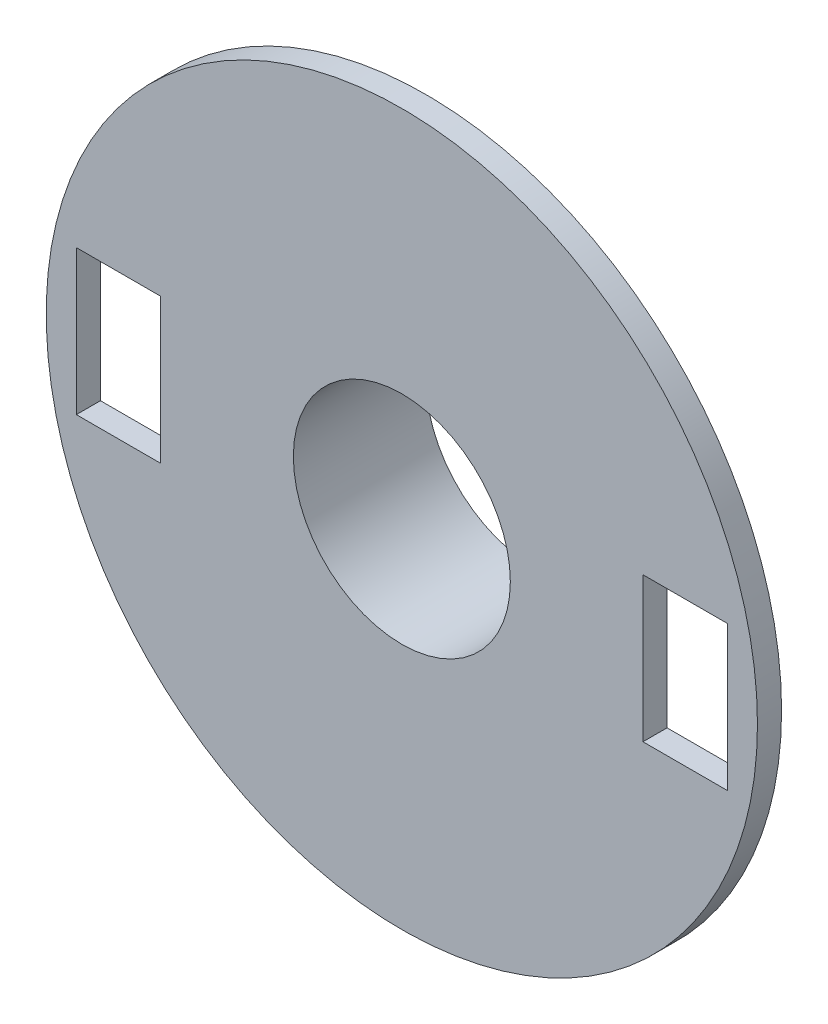
ISO-10303-21;
HEADER;
FILE_DESCRIPTION(('STEP AP214'),'2;1');
FILE_NAME('part.step','',(''),(''),'','','');
FILE_SCHEMA(('AUTOMOTIVE_DESIGN { 1 0 10303 214 1 1 1 1 }'));
ENDSEC;
DATA;
#1=APPLICATION_CONTEXT('core data for automotive mechanical design processes');
#2=APPLICATION_PROTOCOL_DEFINITION('international standard','automotive_design',2000,#1);
#3=PRODUCT_CONTEXT('',#1,'mechanical');
#4=PRODUCT('Part','Part','',(#3));
#5=PRODUCT_RELATED_PRODUCT_CATEGORY('part','',(#4));
#6=PRODUCT_DEFINITION_FORMATION('','',#4);
#7=PRODUCT_DEFINITION_CONTEXT('part definition',#1,'design');
#8=PRODUCT_DEFINITION('design','',#6,#7);
#9=PRODUCT_DEFINITION_SHAPE('','',#8);
#10=(LENGTH_UNIT() NAMED_UNIT(*) SI_UNIT(.MILLI.,.METRE.));
#11=(NAMED_UNIT(*) PLANE_ANGLE_UNIT() SI_UNIT($,.RADIAN.));
#12=(NAMED_UNIT(*) SI_UNIT($,.STERADIAN.) SOLID_ANGLE_UNIT());
#13=UNCERTAINTY_MEASURE_WITH_UNIT(LENGTH_MEASURE(1.E-05),#10,'distance_accuracy_value','');
#14=(GEOMETRIC_REPRESENTATION_CONTEXT(3) GLOBAL_UNCERTAINTY_ASSIGNED_CONTEXT((#13)) GLOBAL_UNIT_ASSIGNED_CONTEXT((#10,
#11,#12)) REPRESENTATION_CONTEXT('',''));
#15=CARTESIAN_POINT('',(0.,0.,0.));
#16=DIRECTION('',(0.,0.,1.));
#17=DIRECTION('',(1.,0.,0.));
#18=AXIS2_PLACEMENT_3D('',#15,#16,#17);
#19=CARTESIAN_POINT('',(0.,0.,1.));
#20=DIRECTION('',(0.,0.,-1.));
#21=DIRECTION('',(-1.,0.,0.));
#22=AXIS2_PLACEMENT_3D('',#19,#20,#21);
#23=CYLINDRICAL_SURFACE('',#22,14.75);
#24=CARTESIAN_POINT('',(0.,0.,1.));
#25=DIRECTION('',(0.,0.,1.));
#26=DIRECTION('',(1.,0.,0.));
#27=AXIS2_PLACEMENT_3D('',#24,#25,#26);
#28=CIRCLE('',#27,14.75);
#29=CARTESIAN_POINT('',(14.75,0.,1.));
#30=VERTEX_POINT('',#29);
#31=EDGE_CURVE('E167',#30,#30,#28,.T.);
#32=ORIENTED_EDGE('',*,*,#31,.F.);
#33=EDGE_LOOP('',(#32));
#34=FACE_BOUND('',#33,.T.);
#35=CARTESIAN_POINT('',(0.,0.,0.));
#36=DIRECTION('',(0.,0.,1.));
#37=DIRECTION('',(1.,0.,0.));
#38=AXIS2_PLACEMENT_3D('',#35,#36,#37);
#39=CIRCLE('',#38,14.75);
#40=CARTESIAN_POINT('',(14.75,0.,0.));
#41=VERTEX_POINT('',#40);
#42=EDGE_CURVE('E162',#41,#41,#39,.T.);
#43=ORIENTED_EDGE('',*,*,#42,.T.);
#44=EDGE_LOOP('',(#43));
#45=FACE_BOUND('',#44,.T.);
#46=ADVANCED_FACE('F35',(#34,#45),#23,.T.);
#47=CARTESIAN_POINT('',(0.,0.,1.));
#48=DIRECTION('',(0.,0.,1.));
#49=DIRECTION('',(1.,0.,0.));
#50=AXIS2_PLACEMENT_3D('',#47,#48,#49);
#51=PLANE('',#50);
#52=DIRECTION('',(0.,1.,0.));
#53=VECTOR('',#52,1.);
#54=CARTESIAN_POINT('',(-13.5,-3.,1.));
#55=LINE('',#54,#53);
#56=CARTESIAN_POINT('',(-13.5,-3.,1.));
#57=VERTEX_POINT('',#56);
#58=CARTESIAN_POINT('',(-13.5,3.,1.));
#59=VERTEX_POINT('',#58);
#60=EDGE_CURVE('E138',#57,#59,#55,.T.);
#61=ORIENTED_EDGE('',*,*,#60,.T.);
#62=DIRECTION('',(1.,0.,0.));
#63=VECTOR('',#62,1.);
#64=CARTESIAN_POINT('',(-13.5,3.,1.));
#65=LINE('',#64,#63);
#66=CARTESIAN_POINT('',(-10.,3.,1.));
#67=VERTEX_POINT('',#66);
#68=EDGE_CURVE('E141',#59,#67,#65,.T.);
#69=ORIENTED_EDGE('',*,*,#68,.T.);
#70=DIRECTION('',(0.,-1.,0.));
#71=VECTOR('',#70,1.);
#72=CARTESIAN_POINT('',(-10.,-3.,1.));
#73=LINE('',#72,#71);
#74=CARTESIAN_POINT('',(-10.,-3.,1.));
#75=VERTEX_POINT('',#74);
#76=EDGE_CURVE('E49',#67,#75,#73,.T.);
#77=ORIENTED_EDGE('',*,*,#76,.T.);
#78=DIRECTION('',(-1.,0.,0.));
#79=VECTOR('',#78,1.);
#80=CARTESIAN_POINT('',(-13.5,-3.,1.));
#81=LINE('',#80,#79);
#82=EDGE_CURVE('E145',#75,#57,#81,.T.);
#83=ORIENTED_EDGE('',*,*,#82,.T.);
#84=EDGE_LOOP('',(#61,#69,#77,#83));
#85=FACE_BOUND('',#84,.T.);
#86=DIRECTION('',(0.,1.,0.));
#87=VECTOR('',#86,1.);
#88=CARTESIAN_POINT('',(10.,-3.,1.));
#89=LINE('',#88,#87);
#90=CARTESIAN_POINT('',(10.,-3.,1.));
#91=VERTEX_POINT('',#90);
#92=CARTESIAN_POINT('',(10.,3.,1.));
#93=VERTEX_POINT('',#92);
#94=EDGE_CURVE('E106',#91,#93,#89,.T.);
#95=ORIENTED_EDGE('',*,*,#94,.T.);
#96=DIRECTION('',(1.,0.,0.));
#97=VECTOR('',#96,1.);
#98=CARTESIAN_POINT('',(13.5,3.,1.));
#99=LINE('',#98,#97);
#100=CARTESIAN_POINT('',(13.5,3.,1.));
#101=VERTEX_POINT('',#100);
#102=EDGE_CURVE('E116',#93,#101,#99,.T.);
#103=ORIENTED_EDGE('',*,*,#102,.T.);
#104=DIRECTION('',(0.,-1.,0.));
#105=VECTOR('',#104,1.);
#106=CARTESIAN_POINT('',(13.5,-3.,1.));
#107=LINE('',#106,#105);
#108=CARTESIAN_POINT('',(13.5,-3.,1.));
#109=VERTEX_POINT('',#108);
#110=EDGE_CURVE('E57',#101,#109,#107,.T.);
#111=ORIENTED_EDGE('',*,*,#110,.T.);
#112=DIRECTION('',(-1.,0.,0.));
#113=VECTOR('',#112,1.);
#114=CARTESIAN_POINT('',(13.5,-3.,1.));
#115=LINE('',#114,#113);
#116=EDGE_CURVE('E113',#109,#91,#115,.T.);
#117=ORIENTED_EDGE('',*,*,#116,.T.);
#118=EDGE_LOOP('',(#95,#103,#111,#117));
#119=FACE_BOUND('',#118,.T.);
#120=CARTESIAN_POINT('',(0.,0.,1.));
#121=DIRECTION('',(0.,0.,-1.));
#122=DIRECTION('',(-1.,0.,0.));
#123=AXIS2_PLACEMENT_3D('',#120,#121,#122);
#124=CIRCLE('',#123,4.5);
#125=CARTESIAN_POINT('',(-4.5,0.,1.));
#126=VERTEX_POINT('',#125);
#127=EDGE_CURVE('E154',#126,#126,#124,.T.);
#128=ORIENTED_EDGE('',*,*,#127,.T.);
#129=EDGE_LOOP('',(#128));
#130=FACE_BOUND('',#129,.T.);
#131=ORIENTED_EDGE('',*,*,#31,.T.);
#132=EDGE_LOOP('',(#131));
#133=FACE_BOUND('',#132,.T.);
#134=ADVANCED_FACE('F120',(#85,#119,#130,#133),#51,.T.);
#135=CARTESIAN_POINT('',(0.,0.,0.));
#136=DIRECTION('',(0.,0.,1.));
#137=DIRECTION('',(1.,0.,0.));
#138=AXIS2_PLACEMENT_3D('',#135,#136,#137);
#139=PLANE('',#138);
#140=DIRECTION('',(-1.,0.,0.));
#141=VECTOR('',#140,1.);
#142=CARTESIAN_POINT('',(0.,3.,0.));
#143=LINE('',#142,#141);
#144=CARTESIAN_POINT('',(-10.,3.,0.));
#145=VERTEX_POINT('',#144);
#146=CARTESIAN_POINT('',(-13.5,3.,0.));
#147=VERTEX_POINT('',#146);
#148=EDGE_CURVE('E180',#145,#147,#143,.T.);
#149=ORIENTED_EDGE('',*,*,#148,.T.);
#150=DIRECTION('',(0.,-1.,0.));
#151=VECTOR('',#150,1.);
#152=CARTESIAN_POINT('',(-13.5,0.,0.));
#153=LINE('',#152,#151);
#154=CARTESIAN_POINT('',(-13.5,-3.,0.));
#155=VERTEX_POINT('',#154);
#156=EDGE_CURVE('E11',#147,#155,#153,.T.);
#157=ORIENTED_EDGE('',*,*,#156,.T.);
#158=DIRECTION('',(1.,0.,0.));
#159=VECTOR('',#158,1.);
#160=CARTESIAN_POINT('',(0.,-3.,0.));
#161=LINE('',#160,#159);
#162=CARTESIAN_POINT('',(-10.,-3.,0.));
#163=VERTEX_POINT('',#162);
#164=EDGE_CURVE('E42',#155,#163,#161,.T.);
#165=ORIENTED_EDGE('',*,*,#164,.T.);
#166=DIRECTION('',(0.,1.,0.));
#167=VECTOR('',#166,1.);
#168=CARTESIAN_POINT('',(-10.,0.,0.));
#169=LINE('',#168,#167);
#170=EDGE_CURVE('E183',#163,#145,#169,.T.);
#171=ORIENTED_EDGE('',*,*,#170,.T.);
#172=EDGE_LOOP('',(#149,#157,#165,#171));
#173=FACE_BOUND('',#172,.T.);
#174=DIRECTION('',(-1.,0.,0.));
#175=VECTOR('',#174,1.);
#176=CARTESIAN_POINT('',(0.,3.,0.));
#177=LINE('',#176,#175);
#178=CARTESIAN_POINT('',(13.5,3.,0.));
#179=VERTEX_POINT('',#178);
#180=CARTESIAN_POINT('',(10.,3.,0.));
#181=VERTEX_POINT('',#180);
#182=EDGE_CURVE('E166',#179,#181,#177,.T.);
#183=ORIENTED_EDGE('',*,*,#182,.T.);
#184=DIRECTION('',(0.,-1.,0.));
#185=VECTOR('',#184,1.);
#186=CARTESIAN_POINT('',(10.,0.,0.));
#187=LINE('',#186,#185);
#188=CARTESIAN_POINT('',(10.,-3.,0.));
#189=VERTEX_POINT('',#188);
#190=EDGE_CURVE('E109',#181,#189,#187,.T.);
#191=ORIENTED_EDGE('',*,*,#190,.T.);
#192=DIRECTION('',(1.,0.,0.));
#193=VECTOR('',#192,1.);
#194=CARTESIAN_POINT('',(0.,-3.,0.));
#195=LINE('',#194,#193);
#196=CARTESIAN_POINT('',(13.5,-3.,0.));
#197=VERTEX_POINT('',#196);
#198=EDGE_CURVE('E176',#189,#197,#195,.T.);
#199=ORIENTED_EDGE('',*,*,#198,.T.);
#200=DIRECTION('',(0.,1.,0.));
#201=VECTOR('',#200,1.);
#202=CARTESIAN_POINT('',(13.5,0.,0.));
#203=LINE('',#202,#201);
#204=EDGE_CURVE('E173',#197,#179,#203,.T.);
#205=ORIENTED_EDGE('',*,*,#204,.T.);
#206=EDGE_LOOP('',(#183,#191,#199,#205));
#207=FACE_BOUND('',#206,.T.);
#208=CARTESIAN_POINT('',(0.,0.,0.));
#209=DIRECTION('',(0.,0.,-1.));
#210=DIRECTION('',(-1.,0.,0.));
#211=AXIS2_PLACEMENT_3D('',#208,#209,#210);
#212=CIRCLE('',#211,5.);
#213=CARTESIAN_POINT('',(-5.,0.,0.));
#214=VERTEX_POINT('',#213);
#215=EDGE_CURVE('E163',#214,#214,#212,.T.);
#216=ORIENTED_EDGE('',*,*,#215,.F.);
#217=EDGE_LOOP('',(#216));
#218=FACE_BOUND('',#217,.T.);
#219=ORIENTED_EDGE('',*,*,#42,.F.);
#220=EDGE_LOOP('',(#219));
#221=FACE_BOUND('',#220,.T.);
#222=ADVANCED_FACE('F187',(#173,#207,#218,#221),#139,.F.);
#223=CARTESIAN_POINT('',(0.,0.,-4.5));
#224=DIRECTION('',(0.,0.,1.));
#225=DIRECTION('',(1.,0.,0.));
#226=AXIS2_PLACEMENT_3D('',#223,#224,#225);
#227=CYLINDRICAL_SURFACE('',#226,5.);
#228=CARTESIAN_POINT('',(0.,0.,-4.5));
#229=DIRECTION('',(0.,0.,-1.));
#230=DIRECTION('',(-1.,0.,0.));
#231=AXIS2_PLACEMENT_3D('',#228,#229,#230);
#232=CIRCLE('',#231,5.);
#233=CARTESIAN_POINT('',(-5.,0.,-4.5));
#234=VERTEX_POINT('',#233);
#235=EDGE_CURVE('E157',#234,#234,#232,.T.);
#236=ORIENTED_EDGE('',*,*,#235,.F.);
#237=EDGE_LOOP('',(#236));
#238=FACE_BOUND('',#237,.T.);
#239=ORIENTED_EDGE('',*,*,#215,.T.);
#240=EDGE_LOOP('',(#239));
#241=FACE_BOUND('',#240,.T.);
#242=ADVANCED_FACE('F220',(#238,#241),#227,.T.);
#243=CARTESIAN_POINT('',(0.,0.,-4.5));
#244=DIRECTION('',(0.,0.,-1.));
#245=DIRECTION('',(-1.,0.,0.));
#246=AXIS2_PLACEMENT_3D('',#243,#244,#245);
#247=PLANE('',#246);
#248=CARTESIAN_POINT('',(0.,0.,-4.5));
#249=DIRECTION('',(0.,0.,-1.));
#250=DIRECTION('',(-1.,0.,0.));
#251=AXIS2_PLACEMENT_3D('',#248,#249,#250);
#252=CIRCLE('',#251,4.5);
#253=CARTESIAN_POINT('',(-4.5,0.,-4.5));
#254=VERTEX_POINT('',#253);
#255=EDGE_CURVE('E133',#254,#254,#252,.T.);
#256=ORIENTED_EDGE('',*,*,#255,.F.);
#257=EDGE_LOOP('',(#256));
#258=FACE_BOUND('',#257,.T.);
#259=ORIENTED_EDGE('',*,*,#235,.T.);
#260=EDGE_LOOP('',(#259));
#261=FACE_BOUND('',#260,.T.);
#262=ADVANCED_FACE('F224',(#258,#261),#247,.T.);
#263=CARTESIAN_POINT('',(0.,0.,1.));
#264=DIRECTION('',(0.,0.,-1.));
#265=DIRECTION('',(-1.,0.,0.));
#266=AXIS2_PLACEMENT_3D('',#263,#264,#265);
#267=CYLINDRICAL_SURFACE('',#266,4.5);
#268=ORIENTED_EDGE('',*,*,#127,.F.);
#269=EDGE_LOOP('',(#268));
#270=FACE_BOUND('',#269,.T.);
#271=ORIENTED_EDGE('',*,*,#255,.T.);
#272=EDGE_LOOP('',(#271));
#273=FACE_BOUND('',#272,.T.);
#274=ADVANCED_FACE('F230',(#270,#273),#267,.F.);
#275=CARTESIAN_POINT('',(10.,-3.,1.));
#276=DIRECTION('',(-1.,0.,0.));
#277=DIRECTION('',(0.,0.,1.));
#278=AXIS2_PLACEMENT_3D('',#275,#276,#277);
#279=PLANE('',#278);
#280=DIRECTION('',(0.,0.,-1.));
#281=VECTOR('',#280,1.);
#282=CARTESIAN_POINT('',(10.,3.,1.));
#283=LINE('',#282,#281);
#284=EDGE_CURVE('E101',#93,#181,#283,.T.);
#285=ORIENTED_EDGE('',*,*,#284,.F.);
#286=ORIENTED_EDGE('',*,*,#94,.F.);
#287=DIRECTION('',(0.,0.,-1.));
#288=VECTOR('',#287,1.);
#289=CARTESIAN_POINT('',(10.,-3.,1.));
#290=LINE('',#289,#288);
#291=EDGE_CURVE('E131',#91,#189,#290,.T.);
#292=ORIENTED_EDGE('',*,*,#291,.T.);
#293=ORIENTED_EDGE('',*,*,#190,.F.);
#294=EDGE_LOOP('',(#285,#286,#292,#293));
#295=FACE_BOUND('',#294,.T.);
#296=ADVANCED_FACE('F103',(#295),#279,.F.);
#297=CARTESIAN_POINT('',(13.5,-3.,1.));
#298=DIRECTION('',(0.,-1.,0.));
#299=DIRECTION('',(0.,0.,-1.));
#300=AXIS2_PLACEMENT_3D('',#297,#298,#299);
#301=PLANE('',#300);
#302=ORIENTED_EDGE('',*,*,#291,.F.);
#303=ORIENTED_EDGE('',*,*,#116,.F.);
#304=DIRECTION('',(0.,0.,-1.));
#305=VECTOR('',#304,1.);
#306=CARTESIAN_POINT('',(13.5,-3.,1.));
#307=LINE('',#306,#305);
#308=EDGE_CURVE('E134',#109,#197,#307,.T.);
#309=ORIENTED_EDGE('',*,*,#308,.T.);
#310=ORIENTED_EDGE('',*,*,#198,.F.);
#311=EDGE_LOOP('',(#302,#303,#309,#310));
#312=FACE_BOUND('',#311,.T.);
#313=ADVANCED_FACE('F244',(#312),#301,.F.);
#314=CARTESIAN_POINT('',(13.5,-3.,1.));
#315=DIRECTION('',(1.,0.,0.));
#316=DIRECTION('',(0.,0.,-1.));
#317=AXIS2_PLACEMENT_3D('',#314,#315,#316);
#318=PLANE('',#317);
#319=ORIENTED_EDGE('',*,*,#308,.F.);
#320=ORIENTED_EDGE('',*,*,#110,.F.);
#321=DIRECTION('',(0.,0.,-1.));
#322=VECTOR('',#321,1.);
#323=CARTESIAN_POINT('',(13.5,3.,1.));
#324=LINE('',#323,#322);
#325=EDGE_CURVE('E112',#101,#179,#324,.T.);
#326=ORIENTED_EDGE('',*,*,#325,.T.);
#327=ORIENTED_EDGE('',*,*,#204,.F.);
#328=EDGE_LOOP('',(#319,#320,#326,#327));
#329=FACE_BOUND('',#328,.T.);
#330=ADVANCED_FACE('F239',(#329),#318,.F.);
#331=CARTESIAN_POINT('',(13.5,3.,1.));
#332=DIRECTION('',(0.,1.,0.));
#333=DIRECTION('',(0.,0.,1.));
#334=AXIS2_PLACEMENT_3D('',#331,#332,#333);
#335=PLANE('',#334);
#336=ORIENTED_EDGE('',*,*,#325,.F.);
#337=ORIENTED_EDGE('',*,*,#102,.F.);
#338=ORIENTED_EDGE('',*,*,#284,.T.);
#339=ORIENTED_EDGE('',*,*,#182,.F.);
#340=EDGE_LOOP('',(#336,#337,#338,#339));
#341=FACE_BOUND('',#340,.T.);
#342=ADVANCED_FACE('F117',(#341),#335,.F.);
#343=CARTESIAN_POINT('',(-13.5,-3.,1.));
#344=DIRECTION('',(-1.,0.,0.));
#345=DIRECTION('',(0.,0.,1.));
#346=AXIS2_PLACEMENT_3D('',#343,#344,#345);
#347=PLANE('',#346);
#348=DIRECTION('',(0.,0.,-1.));
#349=VECTOR('',#348,1.);
#350=CARTESIAN_POINT('',(-13.5,3.,1.));
#351=LINE('',#350,#349);
#352=EDGE_CURVE('E147',#59,#147,#351,.T.);
#353=ORIENTED_EDGE('',*,*,#352,.F.);
#354=ORIENTED_EDGE('',*,*,#60,.F.);
#355=DIRECTION('',(0.,0.,-1.));
#356=VECTOR('',#355,1.);
#357=CARTESIAN_POINT('',(-13.5,-3.,1.));
#358=LINE('',#357,#356);
#359=EDGE_CURVE('E123',#57,#155,#358,.T.);
#360=ORIENTED_EDGE('',*,*,#359,.T.);
#361=ORIENTED_EDGE('',*,*,#156,.F.);
#362=EDGE_LOOP('',(#353,#354,#360,#361));
#363=FACE_BOUND('',#362,.T.);
#364=ADVANCED_FACE('F195',(#363),#347,.F.);
#365=CARTESIAN_POINT('',(-13.5,-3.,1.));
#366=DIRECTION('',(0.,-1.,0.));
#367=DIRECTION('',(0.,0.,-1.));
#368=AXIS2_PLACEMENT_3D('',#365,#366,#367);
#369=PLANE('',#368);
#370=ORIENTED_EDGE('',*,*,#359,.F.);
#371=ORIENTED_EDGE('',*,*,#82,.F.);
#372=DIRECTION('',(0.,0.,-1.));
#373=VECTOR('',#372,1.);
#374=CARTESIAN_POINT('',(-10.,-3.,1.));
#375=LINE('',#374,#373);
#376=EDGE_CURVE('E126',#75,#163,#375,.T.);
#377=ORIENTED_EDGE('',*,*,#376,.T.);
#378=ORIENTED_EDGE('',*,*,#164,.F.);
#379=EDGE_LOOP('',(#370,#371,#377,#378));
#380=FACE_BOUND('',#379,.T.);
#381=ADVANCED_FACE('F191',(#380),#369,.F.);
#382=CARTESIAN_POINT('',(-10.,-3.,1.));
#383=DIRECTION('',(1.,0.,0.));
#384=DIRECTION('',(0.,0.,-1.));
#385=AXIS2_PLACEMENT_3D('',#382,#383,#384);
#386=PLANE('',#385);
#387=ORIENTED_EDGE('',*,*,#376,.F.);
#388=ORIENTED_EDGE('',*,*,#76,.F.);
#389=DIRECTION('',(0.,0.,-1.));
#390=VECTOR('',#389,1.);
#391=CARTESIAN_POINT('',(-10.,3.,1.));
#392=LINE('',#391,#390);
#393=EDGE_CURVE('E151',#67,#145,#392,.T.);
#394=ORIENTED_EDGE('',*,*,#393,.T.);
#395=ORIENTED_EDGE('',*,*,#170,.F.);
#396=EDGE_LOOP('',(#387,#388,#394,#395));
#397=FACE_BOUND('',#396,.T.);
#398=ADVANCED_FACE('F200',(#397),#386,.F.);
#399=CARTESIAN_POINT('',(-13.5,3.,1.));
#400=DIRECTION('',(0.,1.,0.));
#401=DIRECTION('',(0.,0.,1.));
#402=AXIS2_PLACEMENT_3D('',#399,#400,#401);
#403=PLANE('',#402);
#404=ORIENTED_EDGE('',*,*,#393,.F.);
#405=ORIENTED_EDGE('',*,*,#68,.F.);
#406=ORIENTED_EDGE('',*,*,#352,.T.);
#407=ORIENTED_EDGE('',*,*,#148,.F.);
#408=EDGE_LOOP('',(#404,#405,#406,#407));
#409=FACE_BOUND('',#408,.T.);
#410=ADVANCED_FACE('F199',(#409),#403,.F.);
#411=CLOSED_SHELL('',(#46,#134,#222,#242,#262,#274,#296,#313,#330,#342,#364,#381,#398,#410));
#412=MANIFOLD_SOLID_BREP('B2',#411);
#413=ADVANCED_BREP_SHAPE_REPRESENTATION('',(#18,#412),#14);
#414=SHAPE_DEFINITION_REPRESENTATION(#9,#413);
ENDSEC;
END-ISO-10303-21;
